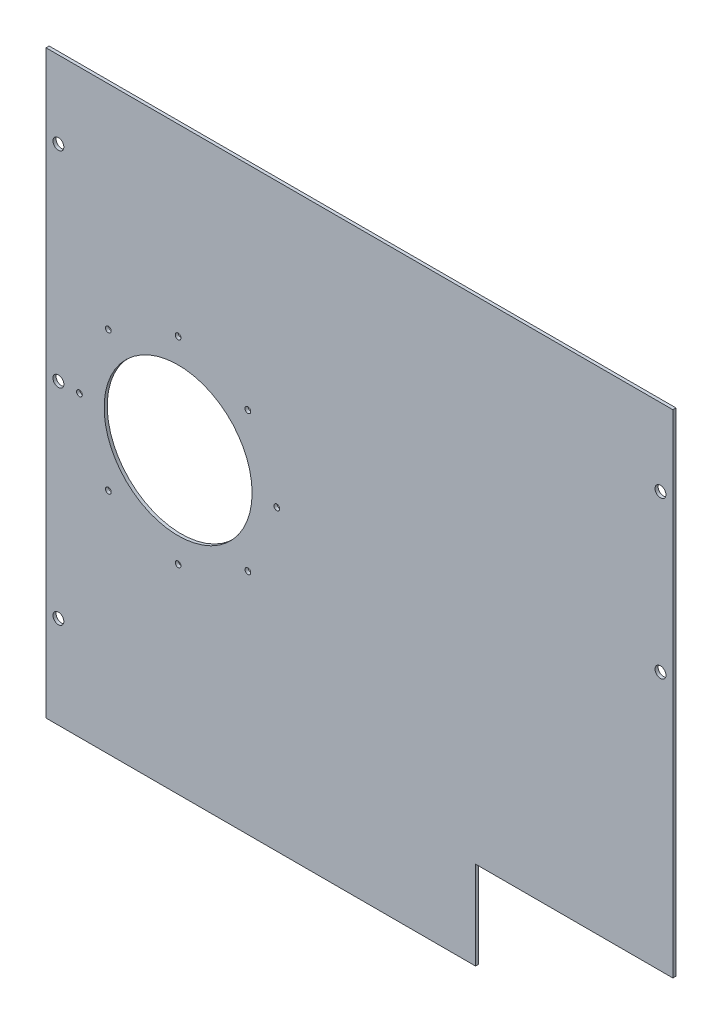
ISO-10303-21;
HEADER;
FILE_DESCRIPTION(('STEP AP214'),'2;1');
FILE_NAME('part.step','',(''),(''),'','','');
FILE_SCHEMA(('AUTOMOTIVE_DESIGN { 1 0 10303 214 1 1 1 1 }'));
ENDSEC;
DATA;
#1=APPLICATION_CONTEXT('core data for automotive mechanical design processes');
#2=APPLICATION_PROTOCOL_DEFINITION('international standard','automotive_design',2000,#1);
#3=PRODUCT_CONTEXT('',#1,'mechanical');
#4=PRODUCT('Part','Part','',(#3));
#5=PRODUCT_RELATED_PRODUCT_CATEGORY('part','',(#4));
#6=PRODUCT_DEFINITION_FORMATION('','',#4);
#7=PRODUCT_DEFINITION_CONTEXT('part definition',#1,'design');
#8=PRODUCT_DEFINITION('design','',#6,#7);
#9=PRODUCT_DEFINITION_SHAPE('','',#8);
#10=(LENGTH_UNIT() NAMED_UNIT(*) SI_UNIT(.MILLI.,.METRE.));
#11=(NAMED_UNIT(*) PLANE_ANGLE_UNIT() SI_UNIT($,.RADIAN.));
#12=(NAMED_UNIT(*) SI_UNIT($,.STERADIAN.) SOLID_ANGLE_UNIT());
#13=UNCERTAINTY_MEASURE_WITH_UNIT(LENGTH_MEASURE(1.E-05),#10,'distance_accuracy_value','');
#14=(GEOMETRIC_REPRESENTATION_CONTEXT(3) GLOBAL_UNCERTAINTY_ASSIGNED_CONTEXT((#13)) GLOBAL_UNIT_ASSIGNED_CONTEXT((#10,
#11,#12)) REPRESENTATION_CONTEXT('',''));
#15=CARTESIAN_POINT('',(0.,0.,0.));
#16=DIRECTION('',(0.,0.,1.));
#17=DIRECTION('',(1.,0.,0.));
#18=AXIS2_PLACEMENT_3D('',#15,#16,#17);
#19=CARTESIAN_POINT('',(-161.3627,145.48590835,1.6002));
#20=DIRECTION('',(1.,0.,0.));
#21=DIRECTION('',(0.,1.,0.));
#22=AXIS2_PLACEMENT_3D('',#19,#20,#21);
#23=PLANE('',#22);
#24=DIRECTION('',(0.,-1.,0.));
#25=VECTOR('',#24,1.);
#26=CARTESIAN_POINT('',(-161.3627,145.48590835,0.));
#27=LINE('',#26,#25);
#28=CARTESIAN_POINT('',(-161.3627,145.48590835,0.));
#29=VERTEX_POINT('',#28);
#30=CARTESIAN_POINT('',(-161.3627,-153.41070835,0.));
#31=VERTEX_POINT('',#30);
#32=EDGE_CURVE('E120',#29,#31,#27,.T.);
#33=ORIENTED_EDGE('',*,*,#32,.T.);
#34=DIRECTION('',(0.,0.,-1.));
#35=VECTOR('',#34,1.);
#36=CARTESIAN_POINT('',(-161.3627,-153.41070835,1.6002));
#37=LINE('',#36,#35);
#38=CARTESIAN_POINT('',(-161.3627,-153.41070835,1.6002));
#39=VERTEX_POINT('',#38);
#40=EDGE_CURVE('E11',#39,#31,#37,.T.);
#41=ORIENTED_EDGE('',*,*,#40,.F.);
#42=DIRECTION('',(0.,-1.,0.));
#43=VECTOR('',#42,1.);
#44=CARTESIAN_POINT('',(-161.3627,145.48590835,1.6002));
#45=LINE('',#44,#43);
#46=CARTESIAN_POINT('',(-161.3627,145.48590835,1.6002));
#47=VERTEX_POINT('',#46);
#48=EDGE_CURVE('E131',#47,#39,#45,.T.);
#49=ORIENTED_EDGE('',*,*,#48,.F.);
#50=DIRECTION('',(0.,0.,-1.));
#51=VECTOR('',#50,1.);
#52=CARTESIAN_POINT('',(-161.3627,145.48590835,1.6002));
#53=LINE('',#52,#51);
#54=EDGE_CURVE('E116',#47,#29,#53,.T.);
#55=ORIENTED_EDGE('',*,*,#54,.T.);
#56=EDGE_LOOP('',(#33,#41,#49,#55));
#57=FACE_BOUND('',#56,.T.);
#58=ADVANCED_FACE('F34',(#57),#23,.F.);
#59=CARTESIAN_POINT('',(-161.3627,-153.41070835,1.6002));
#60=DIRECTION('',(0.,1.,0.));
#61=DIRECTION('',(-1.,0.,0.));
#62=AXIS2_PLACEMENT_3D('',#59,#60,#61);
#63=PLANE('',#62);
#64=DIRECTION('',(1.,0.,0.));
#65=VECTOR('',#64,1.);
#66=CARTESIAN_POINT('',(-161.3627,-153.41070835,0.));
#67=LINE('',#66,#65);
#68=CARTESIAN_POINT('',(59.7625000000001,-153.41070835,0.));
#69=VERTEX_POINT('',#68);
#70=EDGE_CURVE('E123',#31,#69,#67,.T.);
#71=ORIENTED_EDGE('',*,*,#70,.T.);
#72=DIRECTION('',(0.,0.,-1.));
#73=VECTOR('',#72,1.);
#74=CARTESIAN_POINT('',(59.7625000000001,-153.41070835,1.6002));
#75=LINE('',#74,#73);
#76=CARTESIAN_POINT('',(59.7625000000001,-153.41070835,1.6002));
#77=VERTEX_POINT('',#76);
#78=EDGE_CURVE('E43',#77,#69,#75,.T.);
#79=ORIENTED_EDGE('',*,*,#78,.F.);
#80=DIRECTION('',(1.,0.,0.));
#81=VECTOR('',#80,1.);
#82=CARTESIAN_POINT('',(-161.3627,-153.41070835,1.6002));
#83=LINE('',#82,#81);
#84=EDGE_CURVE('E89',#39,#77,#83,.T.);
#85=ORIENTED_EDGE('',*,*,#84,.F.);
#86=ORIENTED_EDGE('',*,*,#40,.T.);
#87=EDGE_LOOP('',(#71,#79,#85,#86));
#88=FACE_BOUND('',#87,.T.);
#89=ADVANCED_FACE('F165',(#88),#63,.F.);
#90=CARTESIAN_POINT('',(59.7625000000001,-107.93570835,1.6002));
#91=DIRECTION('',(-1.,0.,0.));
#92=DIRECTION('',(0.,-1.,0.));
#93=AXIS2_PLACEMENT_3D('',#90,#91,#92);
#94=PLANE('',#93);
#95=DIRECTION('',(0.,1.,0.));
#96=VECTOR('',#95,1.);
#97=CARTESIAN_POINT('',(59.7625000000001,-107.93570835,0.));
#98=LINE('',#97,#96);
#99=CARTESIAN_POINT('',(59.7625000000001,-107.93570835,0.));
#100=VERTEX_POINT('',#99);
#101=EDGE_CURVE('E126',#69,#100,#98,.T.);
#102=ORIENTED_EDGE('',*,*,#101,.T.);
#103=DIRECTION('',(0.,0.,-1.));
#104=VECTOR('',#103,1.);
#105=CARTESIAN_POINT('',(59.7625000000001,-107.93570835,1.6002));
#106=LINE('',#105,#104);
#107=CARTESIAN_POINT('',(59.7625000000001,-107.93570835,1.6002));
#108=VERTEX_POINT('',#107);
#109=EDGE_CURVE('E111',#108,#100,#106,.T.);
#110=ORIENTED_EDGE('',*,*,#109,.F.);
#111=DIRECTION('',(0.,1.,0.));
#112=VECTOR('',#111,1.);
#113=CARTESIAN_POINT('',(59.7625000000001,-107.93570835,1.6002));
#114=LINE('',#113,#112);
#115=EDGE_CURVE('E102',#77,#108,#114,.T.);
#116=ORIENTED_EDGE('',*,*,#115,.F.);
#117=ORIENTED_EDGE('',*,*,#78,.T.);
#118=EDGE_LOOP('',(#102,#110,#116,#117));
#119=FACE_BOUND('',#118,.T.);
#120=ADVANCED_FACE('F168',(#119),#94,.F.);
#121=CARTESIAN_POINT('',(161.3627,-107.93570835,1.6002));
#122=DIRECTION('',(0.,1.,0.));
#123=DIRECTION('',(-1.,0.,0.));
#124=AXIS2_PLACEMENT_3D('',#121,#122,#123);
#125=PLANE('',#124);
#126=DIRECTION('',(1.,0.,0.));
#127=VECTOR('',#126,1.);
#128=CARTESIAN_POINT('',(161.3627,-107.93570835,0.));
#129=LINE('',#128,#127);
#130=CARTESIAN_POINT('',(161.3627,-107.93570835,0.));
#131=VERTEX_POINT('',#130);
#132=EDGE_CURVE('E110',#100,#131,#129,.T.);
#133=ORIENTED_EDGE('',*,*,#132,.T.);
#134=DIRECTION('',(0.,0.,-1.));
#135=VECTOR('',#134,1.);
#136=CARTESIAN_POINT('',(161.3627,-107.93570835,1.6002));
#137=LINE('',#136,#135);
#138=CARTESIAN_POINT('',(161.3627,-107.93570835,1.6002));
#139=VERTEX_POINT('',#138);
#140=EDGE_CURVE('E107',#139,#131,#137,.T.);
#141=ORIENTED_EDGE('',*,*,#140,.F.);
#142=DIRECTION('',(1.,0.,0.));
#143=VECTOR('',#142,1.);
#144=CARTESIAN_POINT('',(161.3627,-107.93570835,1.6002));
#145=LINE('',#144,#143);
#146=EDGE_CURVE('E96',#108,#139,#145,.T.);
#147=ORIENTED_EDGE('',*,*,#146,.F.);
#148=ORIENTED_EDGE('',*,*,#109,.T.);
#149=EDGE_LOOP('',(#133,#141,#147,#148));
#150=FACE_BOUND('',#149,.T.);
#151=ADVANCED_FACE('F108',(#150),#125,.F.);
#152=CARTESIAN_POINT('',(161.3627,145.48590835,1.6002));
#153=DIRECTION('',(-1.,0.,0.));
#154=DIRECTION('',(0.,-1.,0.));
#155=AXIS2_PLACEMENT_3D('',#152,#153,#154);
#156=PLANE('',#155);
#157=DIRECTION('',(0.,1.,0.));
#158=VECTOR('',#157,1.);
#159=CARTESIAN_POINT('',(161.3627,145.48590835,0.));
#160=LINE('',#159,#158);
#161=CARTESIAN_POINT('',(161.3627,145.48590835,0.));
#162=VERTEX_POINT('',#161);
#163=EDGE_CURVE('E75',#131,#162,#160,.T.);
#164=ORIENTED_EDGE('',*,*,#163,.T.);
#165=DIRECTION('',(0.,0.,-1.));
#166=VECTOR('',#165,1.);
#167=CARTESIAN_POINT('',(161.3627,145.48590835,1.6002));
#168=LINE('',#167,#166);
#169=CARTESIAN_POINT('',(161.3627,145.48590835,1.6002));
#170=VERTEX_POINT('',#169);
#171=EDGE_CURVE('E112',#170,#162,#168,.T.);
#172=ORIENTED_EDGE('',*,*,#171,.F.);
#173=DIRECTION('',(0.,1.,0.));
#174=VECTOR('',#173,1.);
#175=CARTESIAN_POINT('',(161.3627,145.48590835,1.6002));
#176=LINE('',#175,#174);
#177=EDGE_CURVE('E100',#139,#170,#176,.T.);
#178=ORIENTED_EDGE('',*,*,#177,.F.);
#179=ORIENTED_EDGE('',*,*,#140,.T.);
#180=EDGE_LOOP('',(#164,#172,#178,#179));
#181=FACE_BOUND('',#180,.T.);
#182=ADVANCED_FACE('F114',(#181),#156,.F.);
#183=CARTESIAN_POINT('',(-161.3627,145.48590835,1.6002));
#184=DIRECTION('',(0.,-1.,0.));
#185=DIRECTION('',(1.,0.,0.));
#186=AXIS2_PLACEMENT_3D('',#183,#184,#185);
#187=PLANE('',#186);
#188=DIRECTION('',(-1.,0.,0.));
#189=VECTOR('',#188,1.);
#190=CARTESIAN_POINT('',(-161.3627,145.48590835,0.));
#191=LINE('',#190,#189);
#192=EDGE_CURVE('E81',#162,#29,#191,.T.);
#193=ORIENTED_EDGE('',*,*,#192,.T.);
#194=ORIENTED_EDGE('',*,*,#54,.F.);
#195=DIRECTION('',(-1.,0.,0.));
#196=VECTOR('',#195,1.);
#197=CARTESIAN_POINT('',(-161.3627,145.48590835,1.6002));
#198=LINE('',#197,#196);
#199=EDGE_CURVE('E52',#170,#47,#198,.T.);
#200=ORIENTED_EDGE('',*,*,#199,.F.);
#201=ORIENTED_EDGE('',*,*,#171,.T.);
#202=EDGE_LOOP('',(#193,#194,#200,#201));
#203=FACE_BOUND('',#202,.T.);
#204=ADVANCED_FACE('F173',(#203),#187,.F.);
#205=CARTESIAN_POINT('',(0.,0.,1.6002));
#206=DIRECTION('',(0.,0.,1.));
#207=DIRECTION('',(1.,0.,0.));
#208=AXIS2_PLACEMENT_3D('',#205,#206,#207);
#209=PLANE('',#208);
#210=CARTESIAN_POINT('',(-155.,105.78570835,1.6002));
#211=DIRECTION('',(0.,0.,1.));
#212=DIRECTION('',(1.,0.,0.));
#213=AXIS2_PLACEMENT_3D('',#210,#211,#212);
#214=CIRCLE('',#213,2.8067);
#215=CARTESIAN_POINT('',(-152.1933,105.78570835,1.6002));
#216=VERTEX_POINT('',#215);
#217=EDGE_CURVE('E366',#216,#216,#214,.T.);
#218=ORIENTED_EDGE('',*,*,#217,.F.);
#219=EDGE_LOOP('',(#218));
#220=FACE_BOUND('',#219,.T.);
#221=CARTESIAN_POINT('',(-155.,0.,1.6002));
#222=DIRECTION('',(0.,0.,1.));
#223=DIRECTION('',(1.,0.,0.));
#224=AXIS2_PLACEMENT_3D('',#221,#222,#223);
#225=CIRCLE('',#224,2.8067);
#226=CARTESIAN_POINT('',(-152.1933,0.,1.6002));
#227=VERTEX_POINT('',#226);
#228=EDGE_CURVE('E370',#227,#227,#225,.T.);
#229=ORIENTED_EDGE('',*,*,#228,.F.);
#230=EDGE_LOOP('',(#229));
#231=FACE_BOUND('',#230,.T.);
#232=CARTESIAN_POINT('',(-155.,-105.78570835,1.6002));
#233=DIRECTION('',(0.,0.,1.));
#234=DIRECTION('',(1.,0.,0.));
#235=AXIS2_PLACEMENT_3D('',#232,#233,#234);
#236=CIRCLE('',#235,2.8067);
#237=CARTESIAN_POINT('',(-152.1933,-105.78570835,1.6002));
#238=VERTEX_POINT('',#237);
#239=EDGE_CURVE('E379',#238,#238,#236,.T.);
#240=ORIENTED_EDGE('',*,*,#239,.F.);
#241=EDGE_LOOP('',(#240));
#242=FACE_BOUND('',#241,.T.);
#243=CARTESIAN_POINT('',(155.,105.78570835,1.6002));
#244=DIRECTION('',(0.,0.,1.));
#245=DIRECTION('',(1.,0.,0.));
#246=AXIS2_PLACEMENT_3D('',#243,#244,#245);
#247=CIRCLE('',#246,2.8067);
#248=CARTESIAN_POINT('',(157.8067,105.78570835,1.6002));
#249=VERTEX_POINT('',#248);
#250=EDGE_CURVE('E382',#249,#249,#247,.T.);
#251=ORIENTED_EDGE('',*,*,#250,.F.);
#252=EDGE_LOOP('',(#251));
#253=FACE_BOUND('',#252,.T.);
#254=CARTESIAN_POINT('',(155.,25.27849165,1.6002));
#255=DIRECTION('',(0.,0.,1.));
#256=DIRECTION('',(1.,0.,0.));
#257=AXIS2_PLACEMENT_3D('',#254,#255,#256);
#258=CIRCLE('',#257,2.8067);
#259=CARTESIAN_POINT('',(157.8067,25.27849165,1.6002));
#260=VERTEX_POINT('',#259);
#261=EDGE_CURVE('E388',#260,#260,#258,.T.);
#262=ORIENTED_EDGE('',*,*,#261,.F.);
#263=EDGE_LOOP('',(#262));
#264=FACE_BOUND('',#263,.T.);
#265=CARTESIAN_POINT('',(-57.4416755157238,35.921024484277,1.6002));
#266=DIRECTION('',(0.,0.,1.));
#267=DIRECTION('',(1.,0.,0.));
#268=AXIS2_PLACEMENT_3D('',#265,#266,#267);
#269=CIRCLE('',#268,1.47319999999999);
#270=CARTESIAN_POINT('',(-55.9684755157238,35.921024484277,1.6002));
#271=VERTEX_POINT('',#270);
#272=EDGE_CURVE('E394',#271,#271,#269,.T.);
#273=ORIENTED_EDGE('',*,*,#272,.F.);
#274=EDGE_LOOP('',(#273));
#275=FACE_BOUND('',#274,.T.);
#276=CARTESIAN_POINT('',(-42.5627,5.27355936696949E-13,1.6002));
#277=DIRECTION('',(0.,0.,1.));
#278=DIRECTION('',(1.,0.,0.));
#279=AXIS2_PLACEMENT_3D('',#276,#277,#278);
#280=CIRCLE('',#279,1.47319999999999);
#281=CARTESIAN_POINT('',(-41.0895,5.27355936696949E-13,1.6002));
#282=VERTEX_POINT('',#281);
#283=EDGE_CURVE('E400',#282,#282,#280,.T.);
#284=ORIENTED_EDGE('',*,*,#283,.F.);
#285=EDGE_LOOP('',(#284));
#286=FACE_BOUND('',#285,.T.);
#287=CARTESIAN_POINT('',(-57.4416755157231,-35.9210244842763,1.6002));
#288=DIRECTION('',(0.,0.,1.));
#289=DIRECTION('',(1.,0.,0.));
#290=AXIS2_PLACEMENT_3D('',#287,#288,#289);
#291=CIRCLE('',#290,1.47319999999999);
#292=CARTESIAN_POINT('',(-55.9684755157231,-35.9210244842763,1.6002));
#293=VERTEX_POINT('',#292);
#294=EDGE_CURVE('E406',#293,#293,#291,.T.);
#295=ORIENTED_EDGE('',*,*,#294,.F.);
#296=EDGE_LOOP('',(#295));
#297=FACE_BOUND('',#296,.T.);
#298=CARTESIAN_POINT('',(-93.3627,-50.8,1.6002));
#299=DIRECTION('',(0.,0.,1.));
#300=DIRECTION('',(1.,0.,0.));
#301=AXIS2_PLACEMENT_3D('',#298,#299,#300);
#302=CIRCLE('',#301,1.47319999999999);
#303=CARTESIAN_POINT('',(-91.8895,-50.8,1.6002));
#304=VERTEX_POINT('',#303);
#305=EDGE_CURVE('E412',#304,#304,#302,.T.);
#306=ORIENTED_EDGE('',*,*,#305,.F.);
#307=EDGE_LOOP('',(#306));
#308=FACE_BOUND('',#307,.T.);
#309=CARTESIAN_POINT('',(-129.283724484276,-35.9210244842768,1.6002));
#310=DIRECTION('',(0.,0.,1.));
#311=DIRECTION('',(1.,0.,0.));
#312=AXIS2_PLACEMENT_3D('',#309,#310,#311);
#313=CIRCLE('',#312,1.47319999999998);
#314=CARTESIAN_POINT('',(-127.810524484276,-35.9210244842768,1.6002));
#315=VERTEX_POINT('',#314);
#316=EDGE_CURVE('E418',#315,#315,#313,.T.);
#317=ORIENTED_EDGE('',*,*,#316,.F.);
#318=EDGE_LOOP('',(#317));
#319=FACE_BOUND('',#318,.T.);
#320=CARTESIAN_POINT('',(-144.1627,-1.80411241501588E-13,1.6002));
#321=DIRECTION('',(0.,0.,1.));
#322=DIRECTION('',(1.,0.,0.));
#323=AXIS2_PLACEMENT_3D('',#320,#321,#322);
#324=CIRCLE('',#323,1.47319999999998);
#325=CARTESIAN_POINT('',(-142.6895,-1.80411241501588E-13,1.6002));
#326=VERTEX_POINT('',#325);
#327=EDGE_CURVE('E154',#326,#326,#324,.T.);
#328=ORIENTED_EDGE('',*,*,#327,.F.);
#329=EDGE_LOOP('',(#328));
#330=FACE_BOUND('',#329,.T.);
#331=CARTESIAN_POINT('',(-129.283724484277,35.9210244842766,1.6002));
#332=DIRECTION('',(0.,0.,1.));
#333=DIRECTION('',(1.,0.,0.));
#334=AXIS2_PLACEMENT_3D('',#331,#332,#333);
#335=CIRCLE('',#334,1.47319999999998);
#336=CARTESIAN_POINT('',(-127.810524484277,35.9210244842766,1.6002));
#337=VERTEX_POINT('',#336);
#338=EDGE_CURVE('E143',#337,#337,#335,.T.);
#339=ORIENTED_EDGE('',*,*,#338,.F.);
#340=EDGE_LOOP('',(#339));
#341=FACE_BOUND('',#340,.T.);
#342=CARTESIAN_POINT('',(-93.3627,50.8,1.6002));
#343=DIRECTION('',(0.,0.,1.));
#344=DIRECTION('',(1.,0.,0.));
#345=AXIS2_PLACEMENT_3D('',#342,#343,#344);
#346=CIRCLE('',#345,1.47319999999999);
#347=CARTESIAN_POINT('',(-91.8895,50.8,1.6002));
#348=VERTEX_POINT('',#347);
#349=EDGE_CURVE('E140',#348,#348,#346,.T.);
#350=ORIENTED_EDGE('',*,*,#349,.F.);
#351=EDGE_LOOP('',(#350));
#352=FACE_BOUND('',#351,.T.);
#353=CARTESIAN_POINT('',(-93.3627,0.,1.6002));
#354=DIRECTION('',(0.,0.,1.));
#355=DIRECTION('',(1.,0.,0.));
#356=AXIS2_PLACEMENT_3D('',#353,#354,#355);
#357=CIRCLE('',#356,38.1);
#358=CARTESIAN_POINT('',(-55.2627,0.,1.6002));
#359=VERTEX_POINT('',#358);
#360=EDGE_CURVE('E139',#359,#359,#357,.T.);
#361=ORIENTED_EDGE('',*,*,#360,.F.);
#362=EDGE_LOOP('',(#361));
#363=FACE_BOUND('',#362,.T.);
#364=ORIENTED_EDGE('',*,*,#48,.T.);
#365=ORIENTED_EDGE('',*,*,#84,.T.);
#366=ORIENTED_EDGE('',*,*,#115,.T.);
#367=ORIENTED_EDGE('',*,*,#146,.T.);
#368=ORIENTED_EDGE('',*,*,#177,.T.);
#369=ORIENTED_EDGE('',*,*,#199,.T.);
#370=EDGE_LOOP('',(#364,#365,#366,#367,#368,#369));
#371=FACE_BOUND('',#370,.T.);
#372=ADVANCED_FACE('F98',(#220,#231,#242,#253,#264,#275,#286,#297,#308,#319,#330,#341,#352,#363,
#371),#209,.T.);
#373=CARTESIAN_POINT('',(0.,0.,0.));
#374=DIRECTION('',(0.,0.,1.));
#375=DIRECTION('',(1.,0.,0.));
#376=AXIS2_PLACEMENT_3D('',#373,#374,#375);
#377=PLANE('',#376);
#378=CARTESIAN_POINT('',(-155.,105.78570835,0.));
#379=DIRECTION('',(0.,0.,1.));
#380=DIRECTION('',(1.,0.,0.));
#381=AXIS2_PLACEMENT_3D('',#378,#379,#380);
#382=CIRCLE('',#381,2.8067);
#383=CARTESIAN_POINT('',(-152.1933,105.78570835,0.));
#384=VERTEX_POINT('',#383);
#385=EDGE_CURVE('E369',#384,#384,#382,.T.);
#386=ORIENTED_EDGE('',*,*,#385,.T.);
#387=EDGE_LOOP('',(#386));
#388=FACE_BOUND('',#387,.T.);
#389=CARTESIAN_POINT('',(-155.,0.,0.));
#390=DIRECTION('',(0.,0.,1.));
#391=DIRECTION('',(1.,0.,0.));
#392=AXIS2_PLACEMENT_3D('',#389,#390,#391);
#393=CIRCLE('',#392,2.8067);
#394=CARTESIAN_POINT('',(-152.1933,0.,0.));
#395=VERTEX_POINT('',#394);
#396=EDGE_CURVE('E373',#395,#395,#393,.T.);
#397=ORIENTED_EDGE('',*,*,#396,.T.);
#398=EDGE_LOOP('',(#397));
#399=FACE_BOUND('',#398,.T.);
#400=CARTESIAN_POINT('',(-155.,-105.78570835,0.));
#401=DIRECTION('',(0.,0.,1.));
#402=DIRECTION('',(1.,0.,0.));
#403=AXIS2_PLACEMENT_3D('',#400,#401,#402);
#404=CIRCLE('',#403,2.8067);
#405=CARTESIAN_POINT('',(-152.1933,-105.78570835,0.));
#406=VERTEX_POINT('',#405);
#407=EDGE_CURVE('E37',#406,#406,#404,.T.);
#408=ORIENTED_EDGE('',*,*,#407,.T.);
#409=EDGE_LOOP('',(#408));
#410=FACE_BOUND('',#409,.T.);
#411=CARTESIAN_POINT('',(155.,105.78570835,0.));
#412=DIRECTION('',(0.,0.,1.));
#413=DIRECTION('',(1.,0.,0.));
#414=AXIS2_PLACEMENT_3D('',#411,#412,#413);
#415=CIRCLE('',#414,2.8067);
#416=CARTESIAN_POINT('',(157.8067,105.78570835,0.));
#417=VERTEX_POINT('',#416);
#418=EDGE_CURVE('E385',#417,#417,#415,.T.);
#419=ORIENTED_EDGE('',*,*,#418,.T.);
#420=EDGE_LOOP('',(#419));
#421=FACE_BOUND('',#420,.T.);
#422=CARTESIAN_POINT('',(155.,25.27849165,0.));
#423=DIRECTION('',(0.,0.,1.));
#424=DIRECTION('',(1.,0.,0.));
#425=AXIS2_PLACEMENT_3D('',#422,#423,#424);
#426=CIRCLE('',#425,2.8067);
#427=CARTESIAN_POINT('',(157.8067,25.27849165,0.));
#428=VERTEX_POINT('',#427);
#429=EDGE_CURVE('E391',#428,#428,#426,.T.);
#430=ORIENTED_EDGE('',*,*,#429,.T.);
#431=EDGE_LOOP('',(#430));
#432=FACE_BOUND('',#431,.T.);
#433=CARTESIAN_POINT('',(-57.4416755157238,35.921024484277,0.));
#434=DIRECTION('',(0.,0.,1.));
#435=DIRECTION('',(1.,0.,0.));
#436=AXIS2_PLACEMENT_3D('',#433,#434,#435);
#437=CIRCLE('',#436,1.47319999999998);
#438=CARTESIAN_POINT('',(-55.9684755157238,35.921024484277,0.));
#439=VERTEX_POINT('',#438);
#440=EDGE_CURVE('E397',#439,#439,#437,.T.);
#441=ORIENTED_EDGE('',*,*,#440,.T.);
#442=EDGE_LOOP('',(#441));
#443=FACE_BOUND('',#442,.T.);
#444=CARTESIAN_POINT('',(-42.5627,5.27355936696949E-13,0.));
#445=DIRECTION('',(0.,0.,1.));
#446=DIRECTION('',(1.,0.,0.));
#447=AXIS2_PLACEMENT_3D('',#444,#445,#446);
#448=CIRCLE('',#447,1.47319999999998);
#449=CARTESIAN_POINT('',(-41.0895,5.27355936696949E-13,0.));
#450=VERTEX_POINT('',#449);
#451=EDGE_CURVE('E403',#450,#450,#448,.T.);
#452=ORIENTED_EDGE('',*,*,#451,.T.);
#453=EDGE_LOOP('',(#452));
#454=FACE_BOUND('',#453,.T.);
#455=CARTESIAN_POINT('',(-57.4416755157231,-35.9210244842763,0.));
#456=DIRECTION('',(0.,0.,1.));
#457=DIRECTION('',(1.,0.,0.));
#458=AXIS2_PLACEMENT_3D('',#455,#456,#457);
#459=CIRCLE('',#458,1.47319999999998);
#460=CARTESIAN_POINT('',(-55.9684755157231,-35.9210244842763,0.));
#461=VERTEX_POINT('',#460);
#462=EDGE_CURVE('E409',#461,#461,#459,.T.);
#463=ORIENTED_EDGE('',*,*,#462,.T.);
#464=EDGE_LOOP('',(#463));
#465=FACE_BOUND('',#464,.T.);
#466=CARTESIAN_POINT('',(-93.3627,-50.8,0.));
#467=DIRECTION('',(0.,0.,1.));
#468=DIRECTION('',(1.,0.,0.));
#469=AXIS2_PLACEMENT_3D('',#466,#467,#468);
#470=CIRCLE('',#469,1.47319999999998);
#471=CARTESIAN_POINT('',(-91.8895,-50.8,0.));
#472=VERTEX_POINT('',#471);
#473=EDGE_CURVE('E415',#472,#472,#470,.T.);
#474=ORIENTED_EDGE('',*,*,#473,.T.);
#475=EDGE_LOOP('',(#474));
#476=FACE_BOUND('',#475,.T.);
#477=CARTESIAN_POINT('',(-129.283724484276,-35.9210244842768,0.));
#478=DIRECTION('',(0.,0.,1.));
#479=DIRECTION('',(1.,0.,0.));
#480=AXIS2_PLACEMENT_3D('',#477,#478,#479);
#481=CIRCLE('',#480,1.47319999999998);
#482=CARTESIAN_POINT('',(-127.810524484276,-35.9210244842768,0.));
#483=VERTEX_POINT('',#482);
#484=EDGE_CURVE('E421',#483,#483,#481,.T.);
#485=ORIENTED_EDGE('',*,*,#484,.T.);
#486=EDGE_LOOP('',(#485));
#487=FACE_BOUND('',#486,.T.);
#488=CARTESIAN_POINT('',(-144.1627,-1.80411241501588E-13,0.));
#489=DIRECTION('',(0.,0.,1.));
#490=DIRECTION('',(1.,0.,0.));
#491=AXIS2_PLACEMENT_3D('',#488,#489,#490);
#492=CIRCLE('',#491,1.47319999999997);
#493=CARTESIAN_POINT('',(-142.6895,-1.80411241501588E-13,0.));
#494=VERTEX_POINT('',#493);
#495=EDGE_CURVE('E149',#494,#494,#492,.T.);
#496=ORIENTED_EDGE('',*,*,#495,.T.);
#497=EDGE_LOOP('',(#496));
#498=FACE_BOUND('',#497,.T.);
#499=CARTESIAN_POINT('',(-129.283724484277,35.9210244842766,0.));
#500=DIRECTION('',(0.,0.,1.));
#501=DIRECTION('',(1.,0.,0.));
#502=AXIS2_PLACEMENT_3D('',#499,#500,#501);
#503=CIRCLE('',#502,1.47319999999997);
#504=CARTESIAN_POINT('',(-127.810524484277,35.9210244842766,0.));
#505=VERTEX_POINT('',#504);
#506=EDGE_CURVE('E141',#505,#505,#503,.T.);
#507=ORIENTED_EDGE('',*,*,#506,.T.);
#508=EDGE_LOOP('',(#507));
#509=FACE_BOUND('',#508,.T.);
#510=CARTESIAN_POINT('',(-93.3627,50.8,0.));
#511=DIRECTION('',(0.,0.,1.));
#512=DIRECTION('',(1.,0.,0.));
#513=AXIS2_PLACEMENT_3D('',#510,#511,#512);
#514=CIRCLE('',#513,1.47319999999998);
#515=CARTESIAN_POINT('',(-91.8895,50.8,0.));
#516=VERTEX_POINT('',#515);
#517=EDGE_CURVE('E137',#516,#516,#514,.T.);
#518=ORIENTED_EDGE('',*,*,#517,.T.);
#519=EDGE_LOOP('',(#518));
#520=FACE_BOUND('',#519,.T.);
#521=CARTESIAN_POINT('',(-93.3627,0.,0.));
#522=DIRECTION('',(0.,0.,1.));
#523=DIRECTION('',(1.,0.,0.));
#524=AXIS2_PLACEMENT_3D('',#521,#522,#523);
#525=CIRCLE('',#524,38.1);
#526=CARTESIAN_POINT('',(-55.2627,0.,0.));
#527=VERTEX_POINT('',#526);
#528=EDGE_CURVE('E124',#527,#527,#525,.T.);
#529=ORIENTED_EDGE('',*,*,#528,.T.);
#530=EDGE_LOOP('',(#529));
#531=FACE_BOUND('',#530,.T.);
#532=ORIENTED_EDGE('',*,*,#32,.F.);
#533=ORIENTED_EDGE('',*,*,#192,.F.);
#534=ORIENTED_EDGE('',*,*,#163,.F.);
#535=ORIENTED_EDGE('',*,*,#132,.F.);
#536=ORIENTED_EDGE('',*,*,#101,.F.);
#537=ORIENTED_EDGE('',*,*,#70,.F.);
#538=EDGE_LOOP('',(#532,#533,#534,#535,#536,#537));
#539=FACE_BOUND('',#538,.T.);
#540=ADVANCED_FACE('F171',(#388,#399,#410,#421,#432,#443,#454,#465,#476,#487,#498,#509,#520,
#531,#539),#377,.F.);
#541=CARTESIAN_POINT('',(-93.3627,0.,0.));
#542=DIRECTION('',(0.,0.,1.));
#543=DIRECTION('',(1.,0.,0.));
#544=AXIS2_PLACEMENT_3D('',#541,#542,#543);
#545=CYLINDRICAL_SURFACE('',#544,38.1);
#546=ORIENTED_EDGE('',*,*,#528,.F.);
#547=EDGE_LOOP('',(#546));
#548=FACE_BOUND('',#547,.T.);
#549=ORIENTED_EDGE('',*,*,#360,.T.);
#550=EDGE_LOOP('',(#549));
#551=FACE_BOUND('',#550,.T.);
#552=ADVANCED_FACE('F212',(#548,#551),#545,.F.);
#553=CARTESIAN_POINT('',(-93.3627,50.8,1.6002));
#554=DIRECTION('',(0.,0.,1.));
#555=DIRECTION('',(1.,0.,0.));
#556=AXIS2_PLACEMENT_3D('',#553,#554,#555);
#557=CYLINDRICAL_SURFACE('',#556,1.47319999999998);
#558=ORIENTED_EDGE('',*,*,#349,.T.);
#559=EDGE_LOOP('',(#558));
#560=FACE_BOUND('',#559,.T.);
#561=ORIENTED_EDGE('',*,*,#517,.F.);
#562=EDGE_LOOP('',(#561));
#563=FACE_BOUND('',#562,.T.);
#564=ADVANCED_FACE('F217',(#560,#563),#557,.F.);
#565=CARTESIAN_POINT('',(-129.283724484277,35.9210244842766,1.6002));
#566=DIRECTION('',(0.,0.,1.));
#567=DIRECTION('',(1.,0.,0.));
#568=AXIS2_PLACEMENT_3D('',#565,#566,#567);
#569=CYLINDRICAL_SURFACE('',#568,1.47319999999997);
#570=ORIENTED_EDGE('',*,*,#338,.T.);
#571=EDGE_LOOP('',(#570));
#572=FACE_BOUND('',#571,.T.);
#573=ORIENTED_EDGE('',*,*,#506,.F.);
#574=EDGE_LOOP('',(#573));
#575=FACE_BOUND('',#574,.T.);
#576=ADVANCED_FACE('F229',(#572,#575),#569,.F.);
#577=CARTESIAN_POINT('',(-144.1627,-1.80411241501588E-13,1.6002));
#578=DIRECTION('',(0.,0.,1.));
#579=DIRECTION('',(1.,0.,0.));
#580=AXIS2_PLACEMENT_3D('',#577,#578,#579);
#581=CYLINDRICAL_SURFACE('',#580,1.47319999999997);
#582=ORIENTED_EDGE('',*,*,#327,.T.);
#583=EDGE_LOOP('',(#582));
#584=FACE_BOUND('',#583,.T.);
#585=ORIENTED_EDGE('',*,*,#495,.F.);
#586=EDGE_LOOP('',(#585));
#587=FACE_BOUND('',#586,.T.);
#588=ADVANCED_FACE('F239',(#584,#587),#581,.F.);
#589=CARTESIAN_POINT('',(-129.283724484276,-35.9210244842768,1.6002));
#590=DIRECTION('',(0.,0.,1.));
#591=DIRECTION('',(1.,0.,0.));
#592=AXIS2_PLACEMENT_3D('',#589,#590,#591);
#593=CYLINDRICAL_SURFACE('',#592,1.47319999999998);
#594=ORIENTED_EDGE('',*,*,#316,.T.);
#595=EDGE_LOOP('',(#594));
#596=FACE_BOUND('',#595,.T.);
#597=ORIENTED_EDGE('',*,*,#484,.F.);
#598=EDGE_LOOP('',(#597));
#599=FACE_BOUND('',#598,.T.);
#600=ADVANCED_FACE('F248',(#596,#599),#593,.F.);
#601=CARTESIAN_POINT('',(-93.3627,-50.8,1.6002));
#602=DIRECTION('',(0.,0.,1.));
#603=DIRECTION('',(1.,0.,0.));
#604=AXIS2_PLACEMENT_3D('',#601,#602,#603);
#605=CYLINDRICAL_SURFACE('',#604,1.47319999999998);
#606=ORIENTED_EDGE('',*,*,#305,.T.);
#607=EDGE_LOOP('',(#606));
#608=FACE_BOUND('',#607,.T.);
#609=ORIENTED_EDGE('',*,*,#473,.F.);
#610=EDGE_LOOP('',(#609));
#611=FACE_BOUND('',#610,.T.);
#612=ADVANCED_FACE('F258',(#608,#611),#605,.F.);
#613=CARTESIAN_POINT('',(-57.4416755157231,-35.9210244842763,1.6002));
#614=DIRECTION('',(0.,0.,1.));
#615=DIRECTION('',(1.,0.,0.));
#616=AXIS2_PLACEMENT_3D('',#613,#614,#615);
#617=CYLINDRICAL_SURFACE('',#616,1.47319999999998);
#618=ORIENTED_EDGE('',*,*,#294,.T.);
#619=EDGE_LOOP('',(#618));
#620=FACE_BOUND('',#619,.T.);
#621=ORIENTED_EDGE('',*,*,#462,.F.);
#622=EDGE_LOOP('',(#621));
#623=FACE_BOUND('',#622,.T.);
#624=ADVANCED_FACE('F268',(#620,#623),#617,.F.);
#625=CARTESIAN_POINT('',(-42.5627,5.27355936696949E-13,1.6002));
#626=DIRECTION('',(0.,0.,1.));
#627=DIRECTION('',(1.,0.,0.));
#628=AXIS2_PLACEMENT_3D('',#625,#626,#627);
#629=CYLINDRICAL_SURFACE('',#628,1.47319999999998);
#630=ORIENTED_EDGE('',*,*,#283,.T.);
#631=EDGE_LOOP('',(#630));
#632=FACE_BOUND('',#631,.T.);
#633=ORIENTED_EDGE('',*,*,#451,.F.);
#634=EDGE_LOOP('',(#633));
#635=FACE_BOUND('',#634,.T.);
#636=ADVANCED_FACE('F278',(#632,#635),#629,.F.);
#637=CARTESIAN_POINT('',(-57.4416755157238,35.921024484277,1.6002));
#638=DIRECTION('',(0.,0.,1.));
#639=DIRECTION('',(1.,0.,0.));
#640=AXIS2_PLACEMENT_3D('',#637,#638,#639);
#641=CYLINDRICAL_SURFACE('',#640,1.47319999999998);
#642=ORIENTED_EDGE('',*,*,#272,.T.);
#643=EDGE_LOOP('',(#642));
#644=FACE_BOUND('',#643,.T.);
#645=ORIENTED_EDGE('',*,*,#440,.F.);
#646=EDGE_LOOP('',(#645));
#647=FACE_BOUND('',#646,.T.);
#648=ADVANCED_FACE('F288',(#644,#647),#641,.F.);
#649=CARTESIAN_POINT('',(155.,25.27849165,1.6002));
#650=DIRECTION('',(0.,0.,1.));
#651=DIRECTION('',(1.,0.,0.));
#652=AXIS2_PLACEMENT_3D('',#649,#650,#651);
#653=CYLINDRICAL_SURFACE('',#652,2.8067);
#654=ORIENTED_EDGE('',*,*,#261,.T.);
#655=EDGE_LOOP('',(#654));
#656=FACE_BOUND('',#655,.T.);
#657=ORIENTED_EDGE('',*,*,#429,.F.);
#658=EDGE_LOOP('',(#657));
#659=FACE_BOUND('',#658,.T.);
#660=ADVANCED_FACE('F298',(#656,#659),#653,.F.);
#661=CARTESIAN_POINT('',(155.,105.78570835,1.6002));
#662=DIRECTION('',(0.,0.,1.));
#663=DIRECTION('',(1.,0.,0.));
#664=AXIS2_PLACEMENT_3D('',#661,#662,#663);
#665=CYLINDRICAL_SURFACE('',#664,2.8067);
#666=ORIENTED_EDGE('',*,*,#250,.T.);
#667=EDGE_LOOP('',(#666));
#668=FACE_BOUND('',#667,.T.);
#669=ORIENTED_EDGE('',*,*,#418,.F.);
#670=EDGE_LOOP('',(#669));
#671=FACE_BOUND('',#670,.T.);
#672=ADVANCED_FACE('F319',(#668,#671),#665,.F.);
#673=CARTESIAN_POINT('',(-155.,-105.78570835,1.6002));
#674=DIRECTION('',(0.,0.,1.));
#675=DIRECTION('',(1.,0.,0.));
#676=AXIS2_PLACEMENT_3D('',#673,#674,#675);
#677=CYLINDRICAL_SURFACE('',#676,2.8067);
#678=ORIENTED_EDGE('',*,*,#239,.T.);
#679=EDGE_LOOP('',(#678));
#680=FACE_BOUND('',#679,.T.);
#681=ORIENTED_EDGE('',*,*,#407,.F.);
#682=EDGE_LOOP('',(#681));
#683=FACE_BOUND('',#682,.T.);
#684=ADVANCED_FACE('F329',(#680,#683),#677,.F.);
#685=CARTESIAN_POINT('',(-155.,0.,1.6002));
#686=DIRECTION('',(0.,0.,1.));
#687=DIRECTION('',(1.,0.,0.));
#688=AXIS2_PLACEMENT_3D('',#685,#686,#687);
#689=CYLINDRICAL_SURFACE('',#688,2.8067);
#690=ORIENTED_EDGE('',*,*,#228,.T.);
#691=EDGE_LOOP('',(#690));
#692=FACE_BOUND('',#691,.T.);
#693=ORIENTED_EDGE('',*,*,#396,.F.);
#694=EDGE_LOOP('',(#693));
#695=FACE_BOUND('',#694,.T.);
#696=ADVANCED_FACE('F339',(#692,#695),#689,.F.);
#697=CARTESIAN_POINT('',(-155.,105.78570835,1.6002));
#698=DIRECTION('',(0.,0.,1.));
#699=DIRECTION('',(1.,0.,0.));
#700=AXIS2_PLACEMENT_3D('',#697,#698,#699);
#701=CYLINDRICAL_SURFACE('',#700,2.8067);
#702=ORIENTED_EDGE('',*,*,#217,.T.);
#703=EDGE_LOOP('',(#702));
#704=FACE_BOUND('',#703,.T.);
#705=ORIENTED_EDGE('',*,*,#385,.F.);
#706=EDGE_LOOP('',(#705));
#707=FACE_BOUND('',#706,.T.);
#708=ADVANCED_FACE('F349',(#704,#707),#701,.F.);
#709=CLOSED_SHELL('',(#58,#89,#120,#151,#182,#204,#372,#540,#552,#564,#576,#588,#600,#612,#624,
#636,#648,#660,#672,#684,#696,#708));
#710=MANIFOLD_SOLID_BREP('B2',#709);
#711=ADVANCED_BREP_SHAPE_REPRESENTATION('',(#18,#710),#14);
#712=SHAPE_DEFINITION_REPRESENTATION(#9,#711);
ENDSEC;
END-ISO-10303-21;
